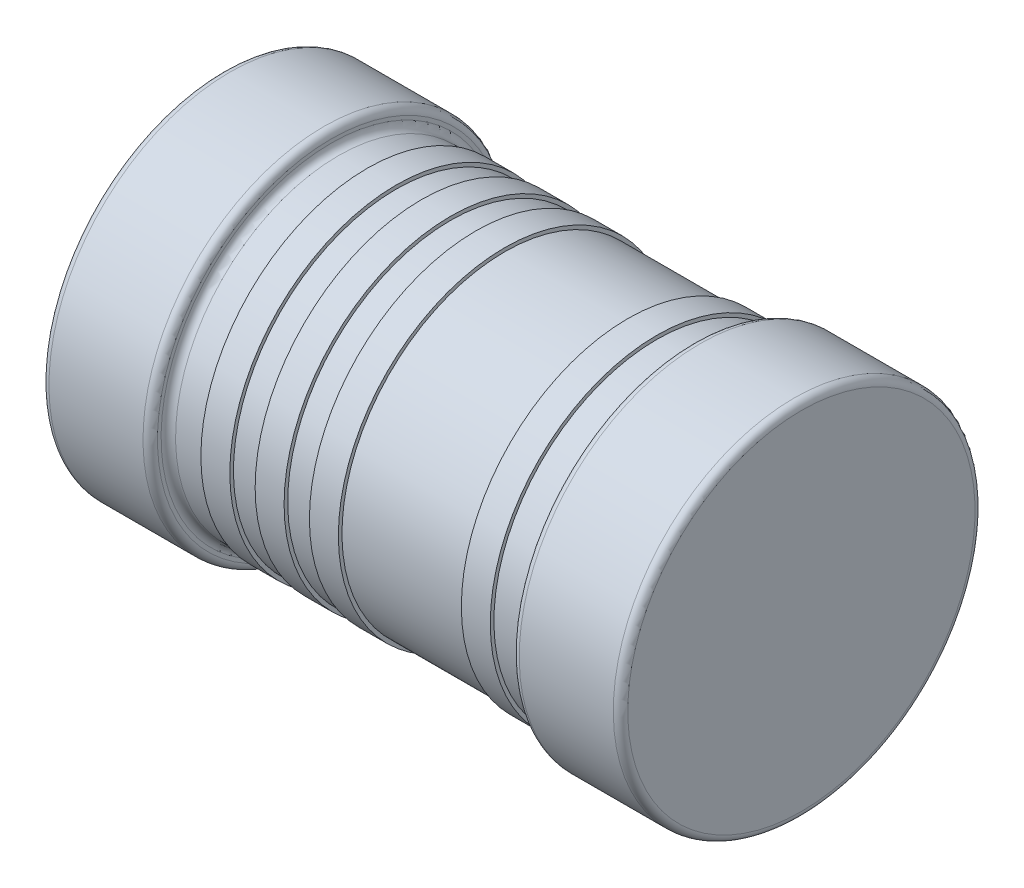
ISO-10303-21;
HEADER;
FILE_DESCRIPTION(('STEP AP214'),'2;1');
FILE_NAME('part.step','',(''),(''),'','','');
FILE_SCHEMA(('AUTOMOTIVE_DESIGN { 1 0 10303 214 1 1 1 1 }'));
ENDSEC;
DATA;
#1=APPLICATION_CONTEXT('core data for automotive mechanical design processes');
#2=APPLICATION_PROTOCOL_DEFINITION('international standard','automotive_design',2000,#1);
#3=PRODUCT_CONTEXT('',#1,'mechanical');
#4=PRODUCT('Part','Part','',(#3));
#5=PRODUCT_RELATED_PRODUCT_CATEGORY('part','',(#4));
#6=PRODUCT_DEFINITION_FORMATION('','',#4);
#7=PRODUCT_DEFINITION_CONTEXT('part definition',#1,'design');
#8=PRODUCT_DEFINITION('design','',#6,#7);
#9=PRODUCT_DEFINITION_SHAPE('','',#8);
#10=(LENGTH_UNIT() NAMED_UNIT(*) SI_UNIT(.MILLI.,.METRE.));
#11=(NAMED_UNIT(*) PLANE_ANGLE_UNIT() SI_UNIT($,.RADIAN.));
#12=(NAMED_UNIT(*) SI_UNIT($,.STERADIAN.) SOLID_ANGLE_UNIT());
#13=UNCERTAINTY_MEASURE_WITH_UNIT(LENGTH_MEASURE(1.E-05),#10,'distance_accuracy_value','');
#14=(GEOMETRIC_REPRESENTATION_CONTEXT(3) GLOBAL_UNCERTAINTY_ASSIGNED_CONTEXT((#13)) GLOBAL_UNIT_ASSIGNED_CONTEXT((#10,
#11,#12)) REPRESENTATION_CONTEXT('',''));
#15=CARTESIAN_POINT('',(0.,0.,0.));
#16=DIRECTION('',(0.,0.,1.));
#17=DIRECTION('',(1.,0.,0.));
#18=AXIS2_PLACEMENT_3D('',#15,#16,#17);
#19=CARTESIAN_POINT('',(-0.8,0.0200000000000001,0.));
#20=DIRECTION('',(1.,0.,0.));
#21=DIRECTION('',(0.,1.,0.));
#22=AXIS2_PLACEMENT_3D('',#19,#20,#21);
#23=PLANE('',#22);
#24=CARTESIAN_POINT('',(-0.8,0.5,0.));
#25=DIRECTION('',(1.,0.,0.));
#26=DIRECTION('',(0.,1.,0.));
#27=AXIS2_PLACEMENT_3D('',#24,#25,#26);
#28=CIRCLE('',#27,0.48);
#29=CARTESIAN_POINT('',(-0.8,0.98,0.));
#30=VERTEX_POINT('',#29);
#31=EDGE_CURVE('E121',#30,#30,#28,.T.);
#32=ORIENTED_EDGE('',*,*,#31,.F.);
#33=EDGE_LOOP('',(#32));
#34=FACE_BOUND('',#33,.T.);
#35=ADVANCED_FACE('F33',(#34),#23,.F.);
#36=CARTESIAN_POINT('',(0.8,0.5,0.));
#37=DIRECTION('',(-1.,0.,0.));
#38=DIRECTION('',(0.,-1.,0.));
#39=AXIS2_PLACEMENT_3D('',#36,#37,#38);
#40=PLANE('',#39);
#41=CARTESIAN_POINT('',(0.8,0.5,0.));
#42=DIRECTION('',(1.,0.,0.));
#43=DIRECTION('',(0.,1.,0.));
#44=AXIS2_PLACEMENT_3D('',#41,#42,#43);
#45=CIRCLE('',#44,0.48);
#46=CARTESIAN_POINT('',(0.8,0.98,0.));
#47=VERTEX_POINT('',#46);
#48=EDGE_CURVE('E10',#47,#47,#45,.T.);
#49=ORIENTED_EDGE('',*,*,#48,.T.);
#50=EDGE_LOOP('',(#49));
#51=FACE_BOUND('',#50,.T.);
#52=ADVANCED_FACE('F128',(#51),#40,.F.);
#53=CARTESIAN_POINT('',(0.78,0.5,0.));
#54=DIRECTION('',(1.,0.,0.));
#55=DIRECTION('',(0.,1.,0.));
#56=AXIS2_PLACEMENT_3D('',#53,#54,#55);
#57=TOROIDAL_SURFACE('',#56,0.48,0.02);
#58=ORIENTED_EDGE('',*,*,#48,.F.);
#59=EDGE_LOOP('',(#58));
#60=FACE_BOUND('',#59,.T.);
#61=CARTESIAN_POINT('',(0.78,0.5,0.));
#62=DIRECTION('',(1.,0.,0.));
#63=DIRECTION('',(0.,1.,0.));
#64=AXIS2_PLACEMENT_3D('',#61,#62,#63);
#65=CIRCLE('',#64,0.5);
#66=CARTESIAN_POINT('',(0.78,1.,0.));
#67=VERTEX_POINT('',#66);
#68=EDGE_CURVE('E39',#67,#67,#65,.T.);
#69=ORIENTED_EDGE('',*,*,#68,.T.);
#70=EDGE_LOOP('',(#69));
#71=FACE_BOUND('',#70,.T.);
#72=ADVANCED_FACE('F132',(#60,#71),#57,.T.);
#73=CARTESIAN_POINT('',(-0.8,0.5,0.));
#74=DIRECTION('',(1.,0.,0.));
#75=DIRECTION('',(0.,1.,0.));
#76=AXIS2_PLACEMENT_3D('',#73,#74,#75);
#77=CYLINDRICAL_SURFACE('',#76,0.5);
#78=ORIENTED_EDGE('',*,*,#68,.F.);
#79=EDGE_LOOP('',(#78));
#80=FACE_BOUND('',#79,.T.);
#81=CARTESIAN_POINT('',(0.52,0.5,0.));
#82=DIRECTION('',(1.,0.,0.));
#83=DIRECTION('',(0.,1.,0.));
#84=AXIS2_PLACEMENT_3D('',#81,#82,#83);
#85=CIRCLE('',#84,0.5);
#86=CARTESIAN_POINT('',(0.52,1.,0.));
#87=VERTEX_POINT('',#86);
#88=EDGE_CURVE('E43',#87,#87,#85,.T.);
#89=ORIENTED_EDGE('',*,*,#88,.T.);
#90=EDGE_LOOP('',(#89));
#91=FACE_BOUND('',#90,.T.);
#92=ADVANCED_FACE('F136',(#80,#91),#77,.T.);
#93=CARTESIAN_POINT('',(0.52,0.5,0.));
#94=DIRECTION('',(1.,0.,0.));
#95=DIRECTION('',(0.,1.,0.));
#96=AXIS2_PLACEMENT_3D('',#93,#94,#95);
#97=TOROIDAL_SURFACE('',#96,0.48,0.02);
#98=ORIENTED_EDGE('',*,*,#88,.F.);
#99=EDGE_LOOP('',(#98));
#100=FACE_BOUND('',#99,.T.);
#101=CARTESIAN_POINT('',(0.5,0.5,0.));
#102=DIRECTION('',(1.,0.,0.));
#103=DIRECTION('',(0.,1.,0.));
#104=AXIS2_PLACEMENT_3D('',#101,#102,#103);
#105=CIRCLE('',#104,0.48);
#106=CARTESIAN_POINT('',(0.5,0.98,0.));
#107=VERTEX_POINT('',#106);
#108=EDGE_CURVE('E47',#107,#107,#105,.T.);
#109=ORIENTED_EDGE('',*,*,#108,.T.);
#110=EDGE_LOOP('',(#109));
#111=FACE_BOUND('',#110,.T.);
#112=ADVANCED_FACE('F142',(#100,#111),#97,.T.);
#113=CARTESIAN_POINT('',(0.5,0.0299999999999999,0.));
#114=DIRECTION('',(1.,0.,0.));
#115=DIRECTION('',(0.,1.,0.));
#116=AXIS2_PLACEMENT_3D('',#113,#114,#115);
#117=PLANE('',#116);
#118=ORIENTED_EDGE('',*,*,#108,.F.);
#119=EDGE_LOOP('',(#118));
#120=FACE_BOUND('',#119,.T.);
#121=CARTESIAN_POINT('',(0.5,0.5,0.));
#122=DIRECTION('',(1.,0.,0.));
#123=DIRECTION('',(0.,1.,0.));
#124=AXIS2_PLACEMENT_3D('',#121,#122,#123);
#125=CIRCLE('',#124,0.47);
#126=CARTESIAN_POINT('',(0.5,0.97,0.));
#127=VERTEX_POINT('',#126);
#128=EDGE_CURVE('E52',#127,#127,#125,.T.);
#129=ORIENTED_EDGE('',*,*,#128,.T.);
#130=EDGE_LOOP('',(#129));
#131=FACE_BOUND('',#130,.T.);
#132=ADVANCED_FACE('F146',(#120,#131),#117,.F.);
#133=CARTESIAN_POINT('',(0.48,0.5,0.));
#134=DIRECTION('',(1.,0.,0.));
#135=DIRECTION('',(0.,1.,0.));
#136=AXIS2_PLACEMENT_3D('',#133,#134,#135);
#137=TOROIDAL_SURFACE('',#136,0.47,0.02);
#138=ORIENTED_EDGE('',*,*,#128,.F.);
#139=EDGE_LOOP('',(#138));
#140=FACE_BOUND('',#139,.T.);
#141=CARTESIAN_POINT('',(0.48,0.5,0.));
#142=DIRECTION('',(1.,0.,0.));
#143=DIRECTION('',(0.,1.,0.));
#144=AXIS2_PLACEMENT_3D('',#141,#142,#143);
#145=CIRCLE('',#144,0.45);
#146=CARTESIAN_POINT('',(0.48,0.95,0.));
#147=VERTEX_POINT('',#146);
#148=EDGE_CURVE('E55',#147,#147,#145,.T.);
#149=ORIENTED_EDGE('',*,*,#148,.T.);
#150=EDGE_LOOP('',(#149));
#151=FACE_BOUND('',#150,.T.);
#152=ADVANCED_FACE('F150',(#140,#151),#137,.F.);
#153=CARTESIAN_POINT('',(-0.8,0.5,0.));
#154=DIRECTION('',(1.,0.,0.));
#155=DIRECTION('',(0.,1.,0.));
#156=AXIS2_PLACEMENT_3D('',#153,#154,#155);
#157=CYLINDRICAL_SURFACE('',#156,0.45);
#158=ORIENTED_EDGE('',*,*,#148,.F.);
#159=EDGE_LOOP('',(#158));
#160=FACE_BOUND('',#159,.T.);
#161=CARTESIAN_POINT('',(0.4,0.5,0.));
#162=DIRECTION('',(1.,0.,0.));
#163=DIRECTION('',(0.,1.,0.));
#164=AXIS2_PLACEMENT_3D('',#161,#162,#163);
#165=CIRCLE('',#164,0.45);
#166=CARTESIAN_POINT('',(0.4,0.95,0.));
#167=VERTEX_POINT('',#166);
#168=EDGE_CURVE('E58',#167,#167,#165,.T.);
#169=ORIENTED_EDGE('',*,*,#168,.T.);
#170=EDGE_LOOP('',(#169));
#171=FACE_BOUND('',#170,.T.);
#172=ADVANCED_FACE('F154',(#160,#171),#157,.T.);
#173=CARTESIAN_POINT('',(0.4,0.05,0.));
#174=DIRECTION('',(-1.,0.,0.));
#175=DIRECTION('',(0.,-1.,0.));
#176=AXIS2_PLACEMENT_3D('',#173,#174,#175);
#177=PLANE('',#176);
#178=ORIENTED_EDGE('',*,*,#168,.F.);
#179=EDGE_LOOP('',(#178));
#180=FACE_BOUND('',#179,.T.);
#181=CARTESIAN_POINT('',(0.4,0.5,0.));
#182=DIRECTION('',(1.,0.,0.));
#183=DIRECTION('',(0.,1.,0.));
#184=AXIS2_PLACEMENT_3D('',#181,#182,#183);
#185=CIRCLE('',#184,0.46);
#186=CARTESIAN_POINT('',(0.4,0.96,0.));
#187=VERTEX_POINT('',#186);
#188=EDGE_CURVE('E61',#187,#187,#185,.T.);
#189=ORIENTED_EDGE('',*,*,#188,.T.);
#190=EDGE_LOOP('',(#189));
#191=FACE_BOUND('',#190,.T.);
#192=ADVANCED_FACE('F158',(#180,#191),#177,.F.);
#193=CARTESIAN_POINT('',(-0.8,0.5,0.));
#194=DIRECTION('',(1.,0.,0.));
#195=DIRECTION('',(0.,1.,0.));
#196=AXIS2_PLACEMENT_3D('',#193,#194,#195);
#197=CYLINDRICAL_SURFACE('',#196,0.46);
#198=ORIENTED_EDGE('',*,*,#188,.F.);
#199=EDGE_LOOP('',(#198));
#200=FACE_BOUND('',#199,.T.);
#201=CARTESIAN_POINT('',(0.32,0.5,0.));
#202=DIRECTION('',(1.,0.,0.));
#203=DIRECTION('',(0.,1.,0.));
#204=AXIS2_PLACEMENT_3D('',#201,#202,#203);
#205=CIRCLE('',#204,0.46);
#206=CARTESIAN_POINT('',(0.32,0.96,0.));
#207=VERTEX_POINT('',#206);
#208=EDGE_CURVE('E64',#207,#207,#205,.T.);
#209=ORIENTED_EDGE('',*,*,#208,.T.);
#210=EDGE_LOOP('',(#209));
#211=FACE_BOUND('',#210,.T.);
#212=ADVANCED_FACE('F162',(#200,#211),#197,.T.);
#213=CARTESIAN_POINT('',(0.32,0.04,0.));
#214=DIRECTION('',(1.,0.,0.));
#215=DIRECTION('',(0.,1.,0.));
#216=AXIS2_PLACEMENT_3D('',#213,#214,#215);
#217=PLANE('',#216);
#218=ORIENTED_EDGE('',*,*,#208,.F.);
#219=EDGE_LOOP('',(#218));
#220=FACE_BOUND('',#219,.T.);
#221=CARTESIAN_POINT('',(0.32,0.5,0.));
#222=DIRECTION('',(1.,0.,0.));
#223=DIRECTION('',(0.,1.,0.));
#224=AXIS2_PLACEMENT_3D('',#221,#222,#223);
#225=CIRCLE('',#224,0.45);
#226=CARTESIAN_POINT('',(0.32,0.95,0.));
#227=VERTEX_POINT('',#226);
#228=EDGE_CURVE('E67',#227,#227,#225,.T.);
#229=ORIENTED_EDGE('',*,*,#228,.T.);
#230=EDGE_LOOP('',(#229));
#231=FACE_BOUND('',#230,.T.);
#232=ADVANCED_FACE('F166',(#220,#231),#217,.F.);
#233=CARTESIAN_POINT('',(-0.8,0.5,0.));
#234=DIRECTION('',(1.,0.,0.));
#235=DIRECTION('',(0.,1.,0.));
#236=AXIS2_PLACEMENT_3D('',#233,#234,#235);
#237=CYLINDRICAL_SURFACE('',#236,0.45);
#238=ORIENTED_EDGE('',*,*,#228,.F.);
#239=EDGE_LOOP('',(#238));
#240=FACE_BOUND('',#239,.T.);
#241=CARTESIAN_POINT('',(-0.0199999999999999,0.5,0.));
#242=DIRECTION('',(1.,0.,0.));
#243=DIRECTION('',(0.,1.,0.));
#244=AXIS2_PLACEMENT_3D('',#241,#242,#243);
#245=CIRCLE('',#244,0.45);
#246=CARTESIAN_POINT('',(-0.02,0.95,0.));
#247=VERTEX_POINT('',#246);
#248=EDGE_CURVE('E70',#247,#247,#245,.T.);
#249=ORIENTED_EDGE('',*,*,#248,.T.);
#250=EDGE_LOOP('',(#249));
#251=FACE_BOUND('',#250,.T.);
#252=ADVANCED_FACE('F170',(#240,#251),#237,.T.);
#253=CARTESIAN_POINT('',(-0.02,0.04,0.));
#254=DIRECTION('',(-1.,0.,0.));
#255=DIRECTION('',(0.,-1.,0.));
#256=AXIS2_PLACEMENT_3D('',#253,#254,#255);
#257=PLANE('',#256);
#258=ORIENTED_EDGE('',*,*,#248,.F.);
#259=EDGE_LOOP('',(#258));
#260=FACE_BOUND('',#259,.T.);
#261=CARTESIAN_POINT('',(-0.0199999999999999,0.5,0.));
#262=DIRECTION('',(1.,0.,0.));
#263=DIRECTION('',(0.,1.,0.));
#264=AXIS2_PLACEMENT_3D('',#261,#262,#263);
#265=CIRCLE('',#264,0.46);
#266=CARTESIAN_POINT('',(-0.02,0.96,0.));
#267=VERTEX_POINT('',#266);
#268=EDGE_CURVE('E73',#267,#267,#265,.T.);
#269=ORIENTED_EDGE('',*,*,#268,.T.);
#270=EDGE_LOOP('',(#269));
#271=FACE_BOUND('',#270,.T.);
#272=ADVANCED_FACE('F174',(#260,#271),#257,.F.);
#273=CARTESIAN_POINT('',(-0.8,0.5,0.));
#274=DIRECTION('',(1.,0.,0.));
#275=DIRECTION('',(0.,1.,0.));
#276=AXIS2_PLACEMENT_3D('',#273,#274,#275);
#277=CYLINDRICAL_SURFACE('',#276,0.46);
#278=ORIENTED_EDGE('',*,*,#268,.F.);
#279=EDGE_LOOP('',(#278));
#280=FACE_BOUND('',#279,.T.);
#281=CARTESIAN_POINT('',(-0.0999999999999999,0.5,0.));
#282=DIRECTION('',(1.,0.,0.));
#283=DIRECTION('',(0.,1.,0.));
#284=AXIS2_PLACEMENT_3D('',#281,#282,#283);
#285=CIRCLE('',#284,0.46);
#286=CARTESIAN_POINT('',(-0.1,0.96,0.));
#287=VERTEX_POINT('',#286);
#288=EDGE_CURVE('E76',#287,#287,#285,.T.);
#289=ORIENTED_EDGE('',*,*,#288,.T.);
#290=EDGE_LOOP('',(#289));
#291=FACE_BOUND('',#290,.T.);
#292=ADVANCED_FACE('F178',(#280,#291),#277,.T.);
#293=CARTESIAN_POINT('',(-0.1,0.04,0.));
#294=DIRECTION('',(1.,0.,0.));
#295=DIRECTION('',(0.,1.,0.));
#296=AXIS2_PLACEMENT_3D('',#293,#294,#295);
#297=PLANE('',#296);
#298=ORIENTED_EDGE('',*,*,#288,.F.);
#299=EDGE_LOOP('',(#298));
#300=FACE_BOUND('',#299,.T.);
#301=CARTESIAN_POINT('',(-0.0999999999999999,0.5,0.));
#302=DIRECTION('',(1.,0.,0.));
#303=DIRECTION('',(0.,1.,0.));
#304=AXIS2_PLACEMENT_3D('',#301,#302,#303);
#305=CIRCLE('',#304,0.45);
#306=CARTESIAN_POINT('',(-0.1,0.95,0.));
#307=VERTEX_POINT('',#306);
#308=EDGE_CURVE('E79',#307,#307,#305,.T.);
#309=ORIENTED_EDGE('',*,*,#308,.T.);
#310=EDGE_LOOP('',(#309));
#311=FACE_BOUND('',#310,.T.);
#312=ADVANCED_FACE('F182',(#300,#311),#297,.F.);
#313=CARTESIAN_POINT('',(-0.8,0.5,0.));
#314=DIRECTION('',(1.,0.,0.));
#315=DIRECTION('',(0.,1.,0.));
#316=AXIS2_PLACEMENT_3D('',#313,#314,#315);
#317=CYLINDRICAL_SURFACE('',#316,0.45);
#318=ORIENTED_EDGE('',*,*,#308,.F.);
#319=EDGE_LOOP('',(#318));
#320=FACE_BOUND('',#319,.T.);
#321=CARTESIAN_POINT('',(-0.17,0.5,0.));
#322=DIRECTION('',(1.,0.,0.));
#323=DIRECTION('',(0.,1.,0.));
#324=AXIS2_PLACEMENT_3D('',#321,#322,#323);
#325=CIRCLE('',#324,0.45);
#326=CARTESIAN_POINT('',(-0.17,0.95,0.));
#327=VERTEX_POINT('',#326);
#328=EDGE_CURVE('E82',#327,#327,#325,.T.);
#329=ORIENTED_EDGE('',*,*,#328,.T.);
#330=EDGE_LOOP('',(#329));
#331=FACE_BOUND('',#330,.T.);
#332=ADVANCED_FACE('F186',(#320,#331),#317,.T.);
#333=CARTESIAN_POINT('',(-0.17,0.04,0.));
#334=DIRECTION('',(-1.,0.,0.));
#335=DIRECTION('',(0.,-1.,0.));
#336=AXIS2_PLACEMENT_3D('',#333,#334,#335);
#337=PLANE('',#336);
#338=ORIENTED_EDGE('',*,*,#328,.F.);
#339=EDGE_LOOP('',(#338));
#340=FACE_BOUND('',#339,.T.);
#341=CARTESIAN_POINT('',(-0.17,0.5,0.));
#342=DIRECTION('',(1.,0.,0.));
#343=DIRECTION('',(0.,1.,0.));
#344=AXIS2_PLACEMENT_3D('',#341,#342,#343);
#345=CIRCLE('',#344,0.46);
#346=CARTESIAN_POINT('',(-0.17,0.96,0.));
#347=VERTEX_POINT('',#346);
#348=EDGE_CURVE('E85',#347,#347,#345,.T.);
#349=ORIENTED_EDGE('',*,*,#348,.T.);
#350=EDGE_LOOP('',(#349));
#351=FACE_BOUND('',#350,.T.);
#352=ADVANCED_FACE('F190',(#340,#351),#337,.F.);
#353=CARTESIAN_POINT('',(-0.8,0.5,0.));
#354=DIRECTION('',(1.,0.,0.));
#355=DIRECTION('',(0.,1.,0.));
#356=AXIS2_PLACEMENT_3D('',#353,#354,#355);
#357=CYLINDRICAL_SURFACE('',#356,0.46);
#358=ORIENTED_EDGE('',*,*,#348,.F.);
#359=EDGE_LOOP('',(#358));
#360=FACE_BOUND('',#359,.T.);
#361=CARTESIAN_POINT('',(-0.25,0.5,0.));
#362=DIRECTION('',(1.,0.,0.));
#363=DIRECTION('',(0.,1.,0.));
#364=AXIS2_PLACEMENT_3D('',#361,#362,#363);
#365=CIRCLE('',#364,0.46);
#366=CARTESIAN_POINT('',(-0.25,0.96,0.));
#367=VERTEX_POINT('',#366);
#368=EDGE_CURVE('E88',#367,#367,#365,.T.);
#369=ORIENTED_EDGE('',*,*,#368,.T.);
#370=EDGE_LOOP('',(#369));
#371=FACE_BOUND('',#370,.T.);
#372=ADVANCED_FACE('F194',(#360,#371),#357,.T.);
#373=CARTESIAN_POINT('',(-0.25,0.05,0.));
#374=DIRECTION('',(1.,0.,0.));
#375=DIRECTION('',(0.,1.,0.));
#376=AXIS2_PLACEMENT_3D('',#373,#374,#375);
#377=PLANE('',#376);
#378=ORIENTED_EDGE('',*,*,#368,.F.);
#379=EDGE_LOOP('',(#378));
#380=FACE_BOUND('',#379,.T.);
#381=CARTESIAN_POINT('',(-0.25,0.5,0.));
#382=DIRECTION('',(1.,0.,0.));
#383=DIRECTION('',(0.,1.,0.));
#384=AXIS2_PLACEMENT_3D('',#381,#382,#383);
#385=CIRCLE('',#384,0.45);
#386=CARTESIAN_POINT('',(-0.25,0.95,0.));
#387=VERTEX_POINT('',#386);
#388=EDGE_CURVE('E91',#387,#387,#385,.T.);
#389=ORIENTED_EDGE('',*,*,#388,.T.);
#390=EDGE_LOOP('',(#389));
#391=FACE_BOUND('',#390,.T.);
#392=ADVANCED_FACE('F198',(#380,#391),#377,.F.);
#393=CARTESIAN_POINT('',(-0.8,0.5,0.));
#394=DIRECTION('',(1.,0.,0.));
#395=DIRECTION('',(0.,1.,0.));
#396=AXIS2_PLACEMENT_3D('',#393,#394,#395);
#397=CYLINDRICAL_SURFACE('',#396,0.45);
#398=ORIENTED_EDGE('',*,*,#388,.F.);
#399=EDGE_LOOP('',(#398));
#400=FACE_BOUND('',#399,.T.);
#401=CARTESIAN_POINT('',(-0.32,0.5,0.));
#402=DIRECTION('',(1.,0.,0.));
#403=DIRECTION('',(0.,1.,0.));
#404=AXIS2_PLACEMENT_3D('',#401,#402,#403);
#405=CIRCLE('',#404,0.45);
#406=CARTESIAN_POINT('',(-0.32,0.95,0.));
#407=VERTEX_POINT('',#406);
#408=EDGE_CURVE('E94',#407,#407,#405,.T.);
#409=ORIENTED_EDGE('',*,*,#408,.T.);
#410=EDGE_LOOP('',(#409));
#411=FACE_BOUND('',#410,.T.);
#412=ADVANCED_FACE('F202',(#400,#411),#397,.T.);
#413=CARTESIAN_POINT('',(-0.32,0.04,0.));
#414=DIRECTION('',(-1.,0.,0.));
#415=DIRECTION('',(0.,-1.,0.));
#416=AXIS2_PLACEMENT_3D('',#413,#414,#415);
#417=PLANE('',#416);
#418=ORIENTED_EDGE('',*,*,#408,.F.);
#419=EDGE_LOOP('',(#418));
#420=FACE_BOUND('',#419,.T.);
#421=CARTESIAN_POINT('',(-0.32,0.5,0.));
#422=DIRECTION('',(1.,0.,0.));
#423=DIRECTION('',(0.,1.,0.));
#424=AXIS2_PLACEMENT_3D('',#421,#422,#423);
#425=CIRCLE('',#424,0.46);
#426=CARTESIAN_POINT('',(-0.32,0.96,0.));
#427=VERTEX_POINT('',#426);
#428=EDGE_CURVE('E97',#427,#427,#425,.T.);
#429=ORIENTED_EDGE('',*,*,#428,.T.);
#430=EDGE_LOOP('',(#429));
#431=FACE_BOUND('',#430,.T.);
#432=ADVANCED_FACE('F206',(#420,#431),#417,.F.);
#433=CARTESIAN_POINT('',(-0.8,0.5,0.));
#434=DIRECTION('',(1.,0.,0.));
#435=DIRECTION('',(0.,1.,0.));
#436=AXIS2_PLACEMENT_3D('',#433,#434,#435);
#437=CYLINDRICAL_SURFACE('',#436,0.46);
#438=ORIENTED_EDGE('',*,*,#428,.F.);
#439=EDGE_LOOP('',(#438));
#440=FACE_BOUND('',#439,.T.);
#441=CARTESIAN_POINT('',(-0.4,0.5,0.));
#442=DIRECTION('',(1.,0.,0.));
#443=DIRECTION('',(0.,1.,0.));
#444=AXIS2_PLACEMENT_3D('',#441,#442,#443);
#445=CIRCLE('',#444,0.46);
#446=CARTESIAN_POINT('',(-0.4,0.96,0.));
#447=VERTEX_POINT('',#446);
#448=EDGE_CURVE('E100',#447,#447,#445,.T.);
#449=ORIENTED_EDGE('',*,*,#448,.T.);
#450=EDGE_LOOP('',(#449));
#451=FACE_BOUND('',#450,.T.);
#452=ADVANCED_FACE('F210',(#440,#451),#437,.T.);
#453=CARTESIAN_POINT('',(-0.4,0.05,0.));
#454=DIRECTION('',(1.,0.,0.));
#455=DIRECTION('',(0.,1.,0.));
#456=AXIS2_PLACEMENT_3D('',#453,#454,#455);
#457=PLANE('',#456);
#458=ORIENTED_EDGE('',*,*,#448,.F.);
#459=EDGE_LOOP('',(#458));
#460=FACE_BOUND('',#459,.T.);
#461=CARTESIAN_POINT('',(-0.4,0.5,0.));
#462=DIRECTION('',(1.,0.,0.));
#463=DIRECTION('',(0.,1.,0.));
#464=AXIS2_PLACEMENT_3D('',#461,#462,#463);
#465=CIRCLE('',#464,0.45);
#466=CARTESIAN_POINT('',(-0.4,0.95,0.));
#467=VERTEX_POINT('',#466);
#468=EDGE_CURVE('E103',#467,#467,#465,.T.);
#469=ORIENTED_EDGE('',*,*,#468,.T.);
#470=EDGE_LOOP('',(#469));
#471=FACE_BOUND('',#470,.T.);
#472=ADVANCED_FACE('F214',(#460,#471),#457,.F.);
#473=CARTESIAN_POINT('',(-0.8,0.5,0.));
#474=DIRECTION('',(1.,0.,0.));
#475=DIRECTION('',(0.,1.,0.));
#476=AXIS2_PLACEMENT_3D('',#473,#474,#475);
#477=CYLINDRICAL_SURFACE('',#476,0.45);
#478=ORIENTED_EDGE('',*,*,#468,.F.);
#479=EDGE_LOOP('',(#478));
#480=FACE_BOUND('',#479,.T.);
#481=CARTESIAN_POINT('',(-0.48,0.5,0.));
#482=DIRECTION('',(1.,0.,0.));
#483=DIRECTION('',(0.,1.,0.));
#484=AXIS2_PLACEMENT_3D('',#481,#482,#483);
#485=CIRCLE('',#484,0.45);
#486=CARTESIAN_POINT('',(-0.48,0.95,0.));
#487=VERTEX_POINT('',#486);
#488=EDGE_CURVE('E106',#487,#487,#485,.T.);
#489=ORIENTED_EDGE('',*,*,#488,.T.);
#490=EDGE_LOOP('',(#489));
#491=FACE_BOUND('',#490,.T.);
#492=ADVANCED_FACE('F218',(#480,#491),#477,.T.);
#493=CARTESIAN_POINT('',(-0.48,0.5,0.));
#494=DIRECTION('',(1.,0.,0.));
#495=DIRECTION('',(0.,1.,0.));
#496=AXIS2_PLACEMENT_3D('',#493,#494,#495);
#497=TOROIDAL_SURFACE('',#496,0.47,0.02);
#498=ORIENTED_EDGE('',*,*,#488,.F.);
#499=EDGE_LOOP('',(#498));
#500=FACE_BOUND('',#499,.T.);
#501=CARTESIAN_POINT('',(-0.5,0.5,0.));
#502=DIRECTION('',(1.,0.,0.));
#503=DIRECTION('',(0.,1.,0.));
#504=AXIS2_PLACEMENT_3D('',#501,#502,#503);
#505=CIRCLE('',#504,0.47);
#506=CARTESIAN_POINT('',(-0.5,0.97,0.));
#507=VERTEX_POINT('',#506);
#508=EDGE_CURVE('E109',#507,#507,#505,.T.);
#509=ORIENTED_EDGE('',*,*,#508,.T.);
#510=EDGE_LOOP('',(#509));
#511=FACE_BOUND('',#510,.T.);
#512=ADVANCED_FACE('F222',(#500,#511),#497,.F.);
#513=CARTESIAN_POINT('',(-0.5,0.0200000000000001,0.));
#514=DIRECTION('',(-1.,0.,0.));
#515=DIRECTION('',(0.,-1.,0.));
#516=AXIS2_PLACEMENT_3D('',#513,#514,#515);
#517=PLANE('',#516);
#518=ORIENTED_EDGE('',*,*,#508,.F.);
#519=EDGE_LOOP('',(#518));
#520=FACE_BOUND('',#519,.T.);
#521=CARTESIAN_POINT('',(-0.5,0.5,0.));
#522=DIRECTION('',(1.,0.,0.));
#523=DIRECTION('',(0.,1.,0.));
#524=AXIS2_PLACEMENT_3D('',#521,#522,#523);
#525=CIRCLE('',#524,0.48);
#526=CARTESIAN_POINT('',(-0.5,0.98,0.));
#527=VERTEX_POINT('',#526);
#528=EDGE_CURVE('E112',#527,#527,#525,.T.);
#529=ORIENTED_EDGE('',*,*,#528,.T.);
#530=EDGE_LOOP('',(#529));
#531=FACE_BOUND('',#530,.T.);
#532=ADVANCED_FACE('F226',(#520,#531),#517,.F.);
#533=CARTESIAN_POINT('',(-0.52,0.5,0.));
#534=DIRECTION('',(1.,0.,0.));
#535=DIRECTION('',(0.,1.,0.));
#536=AXIS2_PLACEMENT_3D('',#533,#534,#535);
#537=TOROIDAL_SURFACE('',#536,0.48,0.02);
#538=ORIENTED_EDGE('',*,*,#528,.F.);
#539=EDGE_LOOP('',(#538));
#540=FACE_BOUND('',#539,.T.);
#541=CARTESIAN_POINT('',(-0.52,0.5,0.));
#542=DIRECTION('',(1.,0.,0.));
#543=DIRECTION('',(0.,1.,0.));
#544=AXIS2_PLACEMENT_3D('',#541,#542,#543);
#545=CIRCLE('',#544,0.5);
#546=CARTESIAN_POINT('',(-0.52,1.,0.));
#547=VERTEX_POINT('',#546);
#548=EDGE_CURVE('E115',#547,#547,#545,.T.);
#549=ORIENTED_EDGE('',*,*,#548,.T.);
#550=EDGE_LOOP('',(#549));
#551=FACE_BOUND('',#550,.T.);
#552=ADVANCED_FACE('F230',(#540,#551),#537,.T.);
#553=CARTESIAN_POINT('',(-0.8,0.5,0.));
#554=DIRECTION('',(1.,0.,0.));
#555=DIRECTION('',(0.,1.,0.));
#556=AXIS2_PLACEMENT_3D('',#553,#554,#555);
#557=CYLINDRICAL_SURFACE('',#556,0.5);
#558=ORIENTED_EDGE('',*,*,#548,.F.);
#559=EDGE_LOOP('',(#558));
#560=FACE_BOUND('',#559,.T.);
#561=CARTESIAN_POINT('',(-0.78,0.5,0.));
#562=DIRECTION('',(1.,0.,0.));
#563=DIRECTION('',(0.,1.,0.));
#564=AXIS2_PLACEMENT_3D('',#561,#562,#563);
#565=CIRCLE('',#564,0.5);
#566=CARTESIAN_POINT('',(-0.78,1.,0.));
#567=VERTEX_POINT('',#566);
#568=EDGE_CURVE('E118',#567,#567,#565,.T.);
#569=ORIENTED_EDGE('',*,*,#568,.T.);
#570=EDGE_LOOP('',(#569));
#571=FACE_BOUND('',#570,.T.);
#572=ADVANCED_FACE('F234',(#560,#571),#557,.T.);
#573=CARTESIAN_POINT('',(-0.78,0.5,0.));
#574=DIRECTION('',(1.,0.,0.));
#575=DIRECTION('',(0.,1.,0.));
#576=AXIS2_PLACEMENT_3D('',#573,#574,#575);
#577=TOROIDAL_SURFACE('',#576,0.48,0.02);
#578=ORIENTED_EDGE('',*,*,#568,.F.);
#579=EDGE_LOOP('',(#578));
#580=FACE_BOUND('',#579,.T.);
#581=ORIENTED_EDGE('',*,*,#31,.T.);
#582=EDGE_LOOP('',(#581));
#583=FACE_BOUND('',#582,.T.);
#584=ADVANCED_FACE('F125',(#580,#583),#577,.T.);
#585=CLOSED_SHELL('',(#35,#52,#72,#92,#112,#132,#152,#172,#192,#212,#232,#252,#272,#292,#312,
#332,#352,#372,#392,#412,#432,#452,#472,#492,#512,#532,#552,#572,#584));
#586=MANIFOLD_SOLID_BREP('B2',#585);
#587=ADVANCED_BREP_SHAPE_REPRESENTATION('',(#18,#586),#14);
#588=SHAPE_DEFINITION_REPRESENTATION(#9,#587);
ENDSEC;
END-ISO-10303-21;
